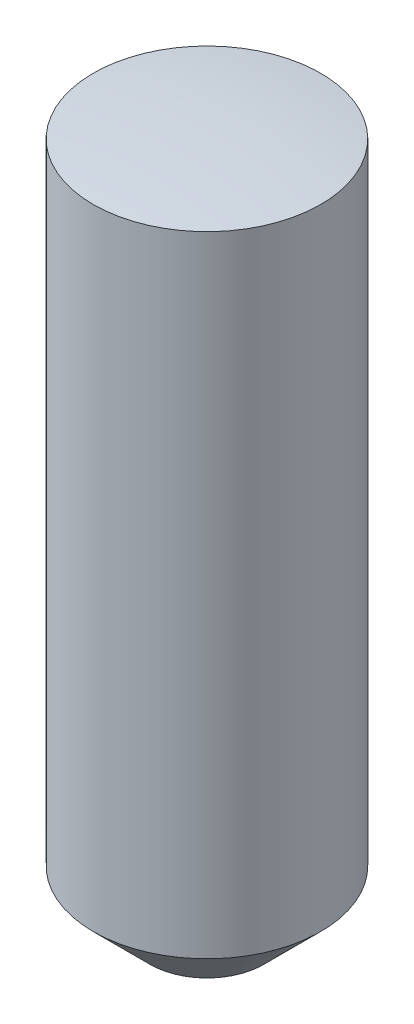
ISO-10303-21;
HEADER;
FILE_DESCRIPTION(('STEP AP214'),'2;1');
FILE_NAME('part.step','',(''),(''),'','','');
FILE_SCHEMA(('AUTOMOTIVE_DESIGN { 1 0 10303 214 1 1 1 1 }'));
ENDSEC;
DATA;
#1=APPLICATION_CONTEXT('core data for automotive mechanical design processes');
#2=APPLICATION_PROTOCOL_DEFINITION('international standard','automotive_design',2000,#1);
#3=PRODUCT_CONTEXT('',#1,'mechanical');
#4=PRODUCT('Part','Part','',(#3));
#5=PRODUCT_RELATED_PRODUCT_CATEGORY('part','',(#4));
#6=PRODUCT_DEFINITION_FORMATION('','',#4);
#7=PRODUCT_DEFINITION_CONTEXT('part definition',#1,'design');
#8=PRODUCT_DEFINITION('design','',#6,#7);
#9=PRODUCT_DEFINITION_SHAPE('','',#8);
#10=(LENGTH_UNIT() NAMED_UNIT(*) SI_UNIT(.MILLI.,.METRE.));
#11=(NAMED_UNIT(*) PLANE_ANGLE_UNIT() SI_UNIT($,.RADIAN.));
#12=(NAMED_UNIT(*) SI_UNIT($,.STERADIAN.) SOLID_ANGLE_UNIT());
#13=UNCERTAINTY_MEASURE_WITH_UNIT(LENGTH_MEASURE(1.E-05),#10,'distance_accuracy_value','');
#14=(GEOMETRIC_REPRESENTATION_CONTEXT(3) GLOBAL_UNCERTAINTY_ASSIGNED_CONTEXT((#13)) GLOBAL_UNIT_ASSIGNED_CONTEXT((#10,
#11,#12)) REPRESENTATION_CONTEXT('',''));
#15=CARTESIAN_POINT('',(0.,0.,0.));
#16=DIRECTION('',(0.,0.,1.));
#17=DIRECTION('',(1.,0.,0.));
#18=AXIS2_PLACEMENT_3D('',#15,#16,#17);
#19=CARTESIAN_POINT('',(0.,-6.1,0.));
#20=DIRECTION('',(0.,1.,0.));
#21=DIRECTION('',(0.,0.,1.));
#22=AXIS2_PLACEMENT_3D('',#19,#20,#21);
#23=PLANE('',#22);
#24=CARTESIAN_POINT('',(0.,-6.10000000000355,0.));
#25=DIRECTION('',(0.,1.,0.));
#26=DIRECTION('',(0.,0.,1.));
#27=AXIS2_PLACEMENT_3D('',#24,#25,#26);
#28=CIRCLE('',#27,0.499999999988177);
#29=CARTESIAN_POINT('',(0.,-6.10000000000355,0.499999999988177));
#30=VERTEX_POINT('',#29);
#31=EDGE_CURVE('E18',#30,#30,#28,.T.);
#32=ORIENTED_EDGE('',*,*,#31,.F.);
#33=EDGE_LOOP('',(#32));
#34=FACE_BOUND('',#33,.T.);
#35=ADVANCED_FACE('F15',(#34),#23,.F.);
#36=CARTESIAN_POINT('',(0.,-5.60000000001537,0.));
#37=DIRECTION('',(0.,1.,0.));
#38=DIRECTION('',(0.,0.,1.));
#39=AXIS2_PLACEMENT_3D('',#36,#37,#38);
#40=CONICAL_SURFACE('',#39,0.999999999976353,0.785398163397448);
#41=CARTESIAN_POINT('',(0.,-5.6,0.));
#42=DIRECTION('',(0.,1.,0.));
#43=DIRECTION('',(0.,0.,1.));
#44=AXIS2_PLACEMENT_3D('',#41,#42,#43);
#45=CIRCLE('',#44,1.);
#46=CARTESIAN_POINT('',(0.,-5.6,1.));
#47=VERTEX_POINT('',#46);
#48=EDGE_CURVE('E22',#47,#47,#45,.T.);
#49=ORIENTED_EDGE('',*,*,#48,.F.);
#50=EDGE_LOOP('',(#49));
#51=FACE_BOUND('',#50,.T.);
#52=ORIENTED_EDGE('',*,*,#31,.T.);
#53=EDGE_LOOP('',(#52));
#54=FACE_BOUND('',#53,.T.);
#55=ADVANCED_FACE('F34',(#51,#54),#40,.T.);
#56=CARTESIAN_POINT('',(0.,-8.,0.));
#57=DIRECTION('',(-1.,0.,0.));
#58=DIRECTION('',(0.,1.,0.));
#59=AXIS2_PLACEMENT_3D('',#56,#57,#58);
#60=SPHERICAL_SURFACE('',#59,8.);
#61=CARTESIAN_POINT('',(0.,-0.0627460668062279,0.));
#62=DIRECTION('',(0.,1.,0.));
#63=DIRECTION('',(0.,0.,1.));
#64=AXIS2_PLACEMENT_3D('',#61,#62,#63);
#65=CIRCLE('',#64,1.);
#66=CARTESIAN_POINT('',(0.,-0.0627460668062279,1.));
#67=VERTEX_POINT('',#66);
#68=EDGE_CURVE('E10',#67,#67,#65,.F.);
#69=ORIENTED_EDGE('',*,*,#68,.F.);
#70=EDGE_LOOP('',(#69));
#71=FACE_BOUND('',#70,.T.);
#72=ADVANCED_FACE('F30',(#71),#60,.T.);
#73=CARTESIAN_POINT('',(0.,-6.1,0.));
#74=DIRECTION('',(0.,1.,0.));
#75=DIRECTION('',(0.,0.,1.));
#76=AXIS2_PLACEMENT_3D('',#73,#74,#75);
#77=CYLINDRICAL_SURFACE('',#76,1.);
#78=ORIENTED_EDGE('',*,*,#68,.T.);
#79=EDGE_LOOP('',(#78));
#80=FACE_BOUND('',#79,.T.);
#81=ORIENTED_EDGE('',*,*,#48,.T.);
#82=EDGE_LOOP('',(#81));
#83=FACE_BOUND('',#82,.T.);
#84=ADVANCED_FACE('F33',(#80,#83),#77,.T.);
#85=CLOSED_SHELL('',(#35,#55,#72,#84));
#86=MANIFOLD_SOLID_BREP('B1',#85);
#87=ADVANCED_BREP_SHAPE_REPRESENTATION('',(#18,#86),#14);
#88=SHAPE_DEFINITION_REPRESENTATION(#9,#87);
ENDSEC;
END-ISO-10303-21;
